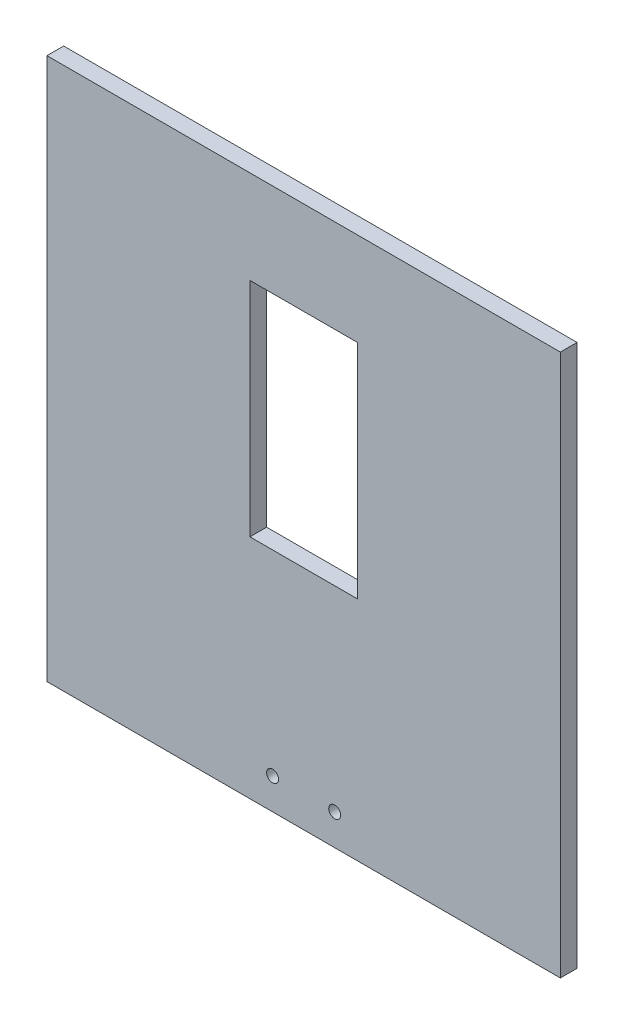
ISO-10303-21;
HEADER;
FILE_DESCRIPTION(('STEP AP214'),'2;1');
FILE_NAME('part.step','',(''),(''),'','','');
FILE_SCHEMA(('AUTOMOTIVE_DESIGN { 1 0 10303 214 1 1 1 1 }'));
ENDSEC;
DATA;
#1=APPLICATION_CONTEXT('core data for automotive mechanical design processes');
#2=APPLICATION_PROTOCOL_DEFINITION('international standard','automotive_design',2000,#1);
#3=PRODUCT_CONTEXT('',#1,'mechanical');
#4=PRODUCT('Part','Part','',(#3));
#5=PRODUCT_RELATED_PRODUCT_CATEGORY('part','',(#4));
#6=PRODUCT_DEFINITION_FORMATION('','',#4);
#7=PRODUCT_DEFINITION_CONTEXT('part definition',#1,'design');
#8=PRODUCT_DEFINITION('design','',#6,#7);
#9=PRODUCT_DEFINITION_SHAPE('','',#8);
#10=(LENGTH_UNIT() NAMED_UNIT(*) SI_UNIT(.MILLI.,.METRE.));
#11=(NAMED_UNIT(*) PLANE_ANGLE_UNIT() SI_UNIT($,.RADIAN.));
#12=(NAMED_UNIT(*) SI_UNIT($,.STERADIAN.) SOLID_ANGLE_UNIT());
#13=UNCERTAINTY_MEASURE_WITH_UNIT(LENGTH_MEASURE(1.E-05),#10,'distance_accuracy_value','');
#14=(GEOMETRIC_REPRESENTATION_CONTEXT(3) GLOBAL_UNCERTAINTY_ASSIGNED_CONTEXT((#13)) GLOBAL_UNIT_ASSIGNED_CONTEXT((#10,
#11,#12)) REPRESENTATION_CONTEXT('',''));
#15=CARTESIAN_POINT('',(0.,0.,0.));
#16=DIRECTION('',(0.,0.,1.));
#17=DIRECTION('',(1.,0.,0.));
#18=AXIS2_PLACEMENT_3D('',#15,#16,#17);
#19=CARTESIAN_POINT('',(0.,77.5893759990332,7.));
#20=DIRECTION('',(0.,1.,0.));
#21=DIRECTION('',(0.,0.,1.));
#22=AXIS2_PLACEMENT_3D('',#19,#20,#21);
#23=PLANE('',#22);
#24=DIRECTION('',(1.,0.,0.));
#25=VECTOR('',#24,1.);
#26=CARTESIAN_POINT('',(0.,77.5893759990332,0.));
#27=LINE('',#26,#25);
#28=CARTESIAN_POINT('',(-22.5,77.5893759990332,0.));
#29=VERTEX_POINT('',#28);
#30=CARTESIAN_POINT('',(22.5,77.5893759990332,0.));
#31=VERTEX_POINT('',#30);
#32=EDGE_CURVE('E149',#29,#31,#27,.T.);
#33=ORIENTED_EDGE('',*,*,#32,.T.);
#34=DIRECTION('',(0.,0.,-1.));
#35=VECTOR('',#34,1.);
#36=CARTESIAN_POINT('',(22.5,77.5893759990332,7.));
#37=LINE('',#36,#35);
#38=CARTESIAN_POINT('',(22.5,77.5893759990332,7.));
#39=VERTEX_POINT('',#38);
#40=EDGE_CURVE('E11',#39,#31,#37,.T.);
#41=ORIENTED_EDGE('',*,*,#40,.F.);
#42=DIRECTION('',(1.,0.,0.));
#43=VECTOR('',#42,1.);
#44=CARTESIAN_POINT('',(0.,77.5893759990332,7.));
#45=LINE('',#44,#43);
#46=CARTESIAN_POINT('',(-22.5,77.5893759990332,7.));
#47=VERTEX_POINT('',#46);
#48=EDGE_CURVE('E114',#47,#39,#45,.T.);
#49=ORIENTED_EDGE('',*,*,#48,.F.);
#50=DIRECTION('',(0.,0.,-1.));
#51=VECTOR('',#50,1.);
#52=CARTESIAN_POINT('',(-22.5,77.5893759990332,7.));
#53=LINE('',#52,#51);
#54=EDGE_CURVE('E53',#47,#29,#53,.T.);
#55=ORIENTED_EDGE('',*,*,#54,.T.);
#56=EDGE_LOOP('',(#33,#41,#49,#55));
#57=FACE_BOUND('',#56,.T.);
#58=ADVANCED_FACE('F34',(#57),#23,.F.);
#59=CARTESIAN_POINT('',(22.5,0.,7.));
#60=DIRECTION('',(1.,0.,0.));
#61=DIRECTION('',(0.,1.,0.));
#62=AXIS2_PLACEMENT_3D('',#59,#60,#61);
#63=PLANE('',#62);
#64=DIRECTION('',(0.,-1.,0.));
#65=VECTOR('',#64,1.);
#66=CARTESIAN_POINT('',(22.5,0.,0.));
#67=LINE('',#66,#65);
#68=CARTESIAN_POINT('',(22.5,-15.4106240009668,0.));
#69=VERTEX_POINT('',#68);
#70=EDGE_CURVE('E120',#31,#69,#67,.T.);
#71=ORIENTED_EDGE('',*,*,#70,.T.);
#72=DIRECTION('',(0.,0.,-1.));
#73=VECTOR('',#72,1.);
#74=CARTESIAN_POINT('',(22.5,-15.4106240009668,7.));
#75=LINE('',#74,#73);
#76=CARTESIAN_POINT('',(22.5,-15.4106240009668,7.));
#77=VERTEX_POINT('',#76);
#78=EDGE_CURVE('E44',#77,#69,#75,.T.);
#79=ORIENTED_EDGE('',*,*,#78,.F.);
#80=DIRECTION('',(0.,-1.,0.));
#81=VECTOR('',#80,1.);
#82=CARTESIAN_POINT('',(22.5,0.,7.));
#83=LINE('',#82,#81);
#84=EDGE_CURVE('E108',#39,#77,#83,.T.);
#85=ORIENTED_EDGE('',*,*,#84,.F.);
#86=ORIENTED_EDGE('',*,*,#40,.T.);
#87=EDGE_LOOP('',(#71,#79,#85,#86));
#88=FACE_BOUND('',#87,.T.);
#89=ADVANCED_FACE('F119',(#88),#63,.F.);
#90=CARTESIAN_POINT('',(0.,-15.4106240009668,7.));
#91=DIRECTION('',(0.,1.,0.));
#92=DIRECTION('',(-1.,0.,0.));
#93=AXIS2_PLACEMENT_3D('',#90,#91,#92);
#94=PLANE('',#93);
#95=DIRECTION('',(1.,0.,0.));
#96=VECTOR('',#95,1.);
#97=CARTESIAN_POINT('',(0.,-15.4106240009668,0.));
#98=LINE('',#97,#96);
#99=CARTESIAN_POINT('',(-22.5,-15.4106240009668,0.));
#100=VERTEX_POINT('',#99);
#101=EDGE_CURVE('E152',#100,#69,#98,.T.);
#102=ORIENTED_EDGE('',*,*,#101,.F.);
#103=DIRECTION('',(0.,0.,-1.));
#104=VECTOR('',#103,1.);
#105=CARTESIAN_POINT('',(-22.5,-15.4106240009668,7.));
#106=LINE('',#105,#104);
#107=CARTESIAN_POINT('',(-22.5,-15.4106240009668,7.));
#108=VERTEX_POINT('',#107);
#109=EDGE_CURVE('E79',#108,#100,#106,.T.);
#110=ORIENTED_EDGE('',*,*,#109,.F.);
#111=DIRECTION('',(1.,0.,0.));
#112=VECTOR('',#111,1.);
#113=CARTESIAN_POINT('',(0.,-15.4106240009668,7.));
#114=LINE('',#113,#112);
#115=EDGE_CURVE('E113',#108,#77,#114,.T.);
#116=ORIENTED_EDGE('',*,*,#115,.T.);
#117=ORIENTED_EDGE('',*,*,#78,.T.);
#118=EDGE_LOOP('',(#102,#110,#116,#117));
#119=FACE_BOUND('',#118,.T.);
#120=ADVANCED_FACE('F124',(#119),#94,.T.);
#121=CARTESIAN_POINT('',(0.,-110.410624000967,7.));
#122=DIRECTION('',(0.,1.,0.));
#123=DIRECTION('',(0.,0.,1.));
#124=AXIS2_PLACEMENT_3D('',#121,#122,#123);
#125=PLANE('',#124);
#126=DIRECTION('',(1.,0.,0.));
#127=VECTOR('',#126,1.);
#128=CARTESIAN_POINT('',(0.,-110.410624000967,0.));
#129=LINE('',#128,#127);
#130=CARTESIAN_POINT('',(-107.5,-110.410624000967,0.));
#131=VERTEX_POINT('',#130);
#132=CARTESIAN_POINT('',(107.5,-110.410624000967,0.));
#133=VERTEX_POINT('',#132);
#134=EDGE_CURVE('E137',#131,#133,#129,.T.);
#135=ORIENTED_EDGE('',*,*,#134,.T.);
#136=DIRECTION('',(0.,0.,-1.));
#137=VECTOR('',#136,1.);
#138=CARTESIAN_POINT('',(107.5,-110.410624000967,7.));
#139=LINE('',#138,#137);
#140=CARTESIAN_POINT('',(107.5,-110.410624000967,7.));
#141=VERTEX_POINT('',#140);
#142=EDGE_CURVE('E38',#141,#133,#139,.T.);
#143=ORIENTED_EDGE('',*,*,#142,.F.);
#144=DIRECTION('',(1.,0.,0.));
#145=VECTOR('',#144,1.);
#146=CARTESIAN_POINT('',(0.,-110.410624000967,7.));
#147=LINE('',#146,#145);
#148=CARTESIAN_POINT('',(-107.5,-110.410624000967,7.));
#149=VERTEX_POINT('',#148);
#150=EDGE_CURVE('E218',#149,#141,#147,.T.);
#151=ORIENTED_EDGE('',*,*,#150,.F.);
#152=DIRECTION('',(0.,0.,-1.));
#153=VECTOR('',#152,1.);
#154=CARTESIAN_POINT('',(-107.5,-110.410624000967,7.));
#155=LINE('',#154,#153);
#156=EDGE_CURVE('E127',#149,#131,#155,.T.);
#157=ORIENTED_EDGE('',*,*,#156,.T.);
#158=EDGE_LOOP('',(#135,#143,#151,#157));
#159=FACE_BOUND('',#158,.T.);
#160=ADVANCED_FACE('F171',(#159),#125,.F.);
#161=CARTESIAN_POINT('',(107.5,0.,7.));
#162=DIRECTION('',(-1.,0.,0.));
#163=DIRECTION('',(0.,0.,1.));
#164=AXIS2_PLACEMENT_3D('',#161,#162,#163);
#165=PLANE('',#164);
#166=DIRECTION('',(0.,1.,0.));
#167=VECTOR('',#166,1.);
#168=CARTESIAN_POINT('',(107.5,0.,0.));
#169=LINE('',#168,#167);
#170=CARTESIAN_POINT('',(107.5,116.589375999033,0.));
#171=VERTEX_POINT('',#170);
#172=EDGE_CURVE('E140',#133,#171,#169,.T.);
#173=ORIENTED_EDGE('',*,*,#172,.T.);
#174=DIRECTION('',(0.,0.,-1.));
#175=VECTOR('',#174,1.);
#176=CARTESIAN_POINT('',(107.5,116.589375999033,7.));
#177=LINE('',#176,#175);
#178=CARTESIAN_POINT('',(107.5,116.589375999033,7.));
#179=VERTEX_POINT('',#178);
#180=EDGE_CURVE('E162',#179,#171,#177,.T.);
#181=ORIENTED_EDGE('',*,*,#180,.F.);
#182=DIRECTION('',(0.,1.,0.));
#183=VECTOR('',#182,1.);
#184=CARTESIAN_POINT('',(107.5,0.,7.));
#185=LINE('',#184,#183);
#186=EDGE_CURVE('E92',#141,#179,#185,.T.);
#187=ORIENTED_EDGE('',*,*,#186,.F.);
#188=ORIENTED_EDGE('',*,*,#142,.T.);
#189=EDGE_LOOP('',(#173,#181,#187,#188));
#190=FACE_BOUND('',#189,.T.);
#191=ADVANCED_FACE('F167',(#190),#165,.F.);
#192=CARTESIAN_POINT('',(0.,116.589375999033,7.));
#193=DIRECTION('',(0.,1.,0.));
#194=DIRECTION('',(0.,0.,1.));
#195=AXIS2_PLACEMENT_3D('',#192,#193,#194);
#196=PLANE('',#195);
#197=DIRECTION('',(1.,0.,0.));
#198=VECTOR('',#197,1.);
#199=CARTESIAN_POINT('',(0.,116.589375999033,0.));
#200=LINE('',#199,#198);
#201=CARTESIAN_POINT('',(-107.5,116.589375999033,0.));
#202=VERTEX_POINT('',#201);
#203=EDGE_CURVE('E143',#202,#171,#200,.T.);
#204=ORIENTED_EDGE('',*,*,#203,.F.);
#205=DIRECTION('',(0.,0.,-1.));
#206=VECTOR('',#205,1.);
#207=CARTESIAN_POINT('',(-107.5,116.589375999033,7.));
#208=LINE('',#207,#206);
#209=CARTESIAN_POINT('',(-107.5,116.589375999033,7.));
#210=VERTEX_POINT('',#209);
#211=EDGE_CURVE('E161',#210,#202,#208,.T.);
#212=ORIENTED_EDGE('',*,*,#211,.F.);
#213=DIRECTION('',(1.,0.,0.));
#214=VECTOR('',#213,1.);
#215=CARTESIAN_POINT('',(0.,116.589375999033,7.));
#216=LINE('',#215,#214);
#217=EDGE_CURVE('E220',#210,#179,#216,.T.);
#218=ORIENTED_EDGE('',*,*,#217,.T.);
#219=ORIENTED_EDGE('',*,*,#180,.T.);
#220=EDGE_LOOP('',(#204,#212,#218,#219));
#221=FACE_BOUND('',#220,.T.);
#222=ADVANCED_FACE('F182',(#221),#196,.T.);
#223=CARTESIAN_POINT('',(-107.5,0.,7.));
#224=DIRECTION('',(-1.,0.,0.));
#225=DIRECTION('',(0.,0.,1.));
#226=AXIS2_PLACEMENT_3D('',#223,#224,#225);
#227=PLANE('',#226);
#228=DIRECTION('',(0.,1.,0.));
#229=VECTOR('',#228,1.);
#230=CARTESIAN_POINT('',(-107.5,0.,0.));
#231=LINE('',#230,#229);
#232=EDGE_CURVE('E146',#131,#202,#231,.T.);
#233=ORIENTED_EDGE('',*,*,#232,.F.);
#234=ORIENTED_EDGE('',*,*,#156,.F.);
#235=DIRECTION('',(0.,1.,0.));
#236=VECTOR('',#235,1.);
#237=CARTESIAN_POINT('',(-107.5,0.,7.));
#238=LINE('',#237,#236);
#239=EDGE_CURVE('E180',#149,#210,#238,.T.);
#240=ORIENTED_EDGE('',*,*,#239,.T.);
#241=ORIENTED_EDGE('',*,*,#211,.T.);
#242=EDGE_LOOP('',(#233,#234,#240,#241));
#243=FACE_BOUND('',#242,.T.);
#244=ADVANCED_FACE('F177',(#243),#227,.T.);
#245=CARTESIAN_POINT('',(-13.,-97.4106240009668,7.));
#246=DIRECTION('',(0.,0.,-1.));
#247=DIRECTION('',(-1.,0.,0.));
#248=AXIS2_PLACEMENT_3D('',#245,#246,#247);
#249=CYLINDRICAL_SURFACE('',#248,2.5);
#250=CARTESIAN_POINT('',(-13.,-97.4106240009668,7.));
#251=DIRECTION('',(0.,0.,1.));
#252=DIRECTION('',(1.,0.,0.));
#253=AXIS2_PLACEMENT_3D('',#250,#251,#252);
#254=CIRCLE('',#253,2.5);
#255=CARTESIAN_POINT('',(-10.5,-97.4106240009668,7.));
#256=VERTEX_POINT('',#255);
#257=EDGE_CURVE('E217',#256,#256,#254,.T.);
#258=ORIENTED_EDGE('',*,*,#257,.T.);
#259=EDGE_LOOP('',(#258));
#260=FACE_BOUND('',#259,.T.);
#261=CARTESIAN_POINT('',(-13.,-97.4106240009668,0.));
#262=DIRECTION('',(0.,0.,1.));
#263=DIRECTION('',(1.,0.,0.));
#264=AXIS2_PLACEMENT_3D('',#261,#262,#263);
#265=CIRCLE('',#264,2.5);
#266=CARTESIAN_POINT('',(-10.5,-97.4106240009668,0.));
#267=VERTEX_POINT('',#266);
#268=EDGE_CURVE('E134',#267,#267,#265,.T.);
#269=ORIENTED_EDGE('',*,*,#268,.F.);
#270=EDGE_LOOP('',(#269));
#271=FACE_BOUND('',#270,.T.);
#272=ADVANCED_FACE('F189',(#260,#271),#249,.F.);
#273=CARTESIAN_POINT('',(13.,-97.4106240009669,7.));
#274=DIRECTION('',(0.,0.,-1.));
#275=DIRECTION('',(-1.,0.,0.));
#276=AXIS2_PLACEMENT_3D('',#273,#274,#275);
#277=CYLINDRICAL_SURFACE('',#276,2.5);
#278=CARTESIAN_POINT('',(13.,-97.4106240009669,7.));
#279=DIRECTION('',(0.,0.,1.));
#280=DIRECTION('',(1.,0.,0.));
#281=AXIS2_PLACEMENT_3D('',#278,#279,#280);
#282=CIRCLE('',#281,2.5);
#283=CARTESIAN_POINT('',(15.5,-97.4106240009669,7.));
#284=VERTEX_POINT('',#283);
#285=EDGE_CURVE('E157',#284,#284,#282,.T.);
#286=ORIENTED_EDGE('',*,*,#285,.T.);
#287=EDGE_LOOP('',(#286));
#288=FACE_BOUND('',#287,.T.);
#289=CARTESIAN_POINT('',(13.,-97.4106240009669,0.));
#290=DIRECTION('',(0.,0.,1.));
#291=DIRECTION('',(1.,0.,0.));
#292=AXIS2_PLACEMENT_3D('',#289,#290,#291);
#293=CIRCLE('',#292,2.5);
#294=CARTESIAN_POINT('',(15.5,-97.4106240009669,0.));
#295=VERTEX_POINT('',#294);
#296=EDGE_CURVE('E131',#295,#295,#293,.T.);
#297=ORIENTED_EDGE('',*,*,#296,.F.);
#298=EDGE_LOOP('',(#297));
#299=FACE_BOUND('',#298,.T.);
#300=ADVANCED_FACE('F36',(#288,#299),#277,.F.);
#301=CARTESIAN_POINT('',(-22.5,0.,7.));
#302=DIRECTION('',(1.,0.,0.));
#303=DIRECTION('',(0.,1.,0.));
#304=AXIS2_PLACEMENT_3D('',#301,#302,#303);
#305=PLANE('',#304);
#306=DIRECTION('',(0.,-1.,0.));
#307=VECTOR('',#306,1.);
#308=CARTESIAN_POINT('',(-22.5,0.,0.));
#309=LINE('',#308,#307);
#310=EDGE_CURVE('E154',#29,#100,#309,.T.);
#311=ORIENTED_EDGE('',*,*,#310,.F.);
#312=ORIENTED_EDGE('',*,*,#54,.F.);
#313=DIRECTION('',(0.,-1.,0.));
#314=VECTOR('',#313,1.);
#315=CARTESIAN_POINT('',(-22.5,0.,7.));
#316=LINE('',#315,#314);
#317=EDGE_CURVE('E125',#47,#108,#316,.T.);
#318=ORIENTED_EDGE('',*,*,#317,.T.);
#319=ORIENTED_EDGE('',*,*,#109,.T.);
#320=EDGE_LOOP('',(#311,#312,#318,#319));
#321=FACE_BOUND('',#320,.T.);
#322=ADVANCED_FACE('F201',(#321),#305,.T.);
#323=CARTESIAN_POINT('',(0.,0.,7.));
#324=DIRECTION('',(0.,0.,1.));
#325=DIRECTION('',(1.,0.,0.));
#326=AXIS2_PLACEMENT_3D('',#323,#324,#325);
#327=PLANE('',#326);
#328=ORIENTED_EDGE('',*,*,#285,.F.);
#329=EDGE_LOOP('',(#328));
#330=FACE_BOUND('',#329,.T.);
#331=ORIENTED_EDGE('',*,*,#257,.F.);
#332=EDGE_LOOP('',(#331));
#333=FACE_BOUND('',#332,.T.);
#334=ORIENTED_EDGE('',*,*,#150,.T.);
#335=ORIENTED_EDGE('',*,*,#186,.T.);
#336=ORIENTED_EDGE('',*,*,#217,.F.);
#337=ORIENTED_EDGE('',*,*,#239,.F.);
#338=EDGE_LOOP('',(#334,#335,#336,#337));
#339=FACE_BOUND('',#338,.T.);
#340=ORIENTED_EDGE('',*,*,#48,.T.);
#341=ORIENTED_EDGE('',*,*,#84,.T.);
#342=ORIENTED_EDGE('',*,*,#115,.F.);
#343=ORIENTED_EDGE('',*,*,#317,.F.);
#344=EDGE_LOOP('',(#340,#341,#342,#343));
#345=FACE_BOUND('',#344,.T.);
#346=ADVANCED_FACE('F110',(#330,#333,#339,#345),#327,.T.);
#347=CARTESIAN_POINT('',(0.,0.,0.));
#348=DIRECTION('',(0.,0.,1.));
#349=DIRECTION('',(1.,0.,0.));
#350=AXIS2_PLACEMENT_3D('',#347,#348,#349);
#351=PLANE('',#350);
#352=ORIENTED_EDGE('',*,*,#296,.T.);
#353=EDGE_LOOP('',(#352));
#354=FACE_BOUND('',#353,.T.);
#355=ORIENTED_EDGE('',*,*,#268,.T.);
#356=EDGE_LOOP('',(#355));
#357=FACE_BOUND('',#356,.T.);
#358=ORIENTED_EDGE('',*,*,#134,.F.);
#359=ORIENTED_EDGE('',*,*,#232,.T.);
#360=ORIENTED_EDGE('',*,*,#203,.T.);
#361=ORIENTED_EDGE('',*,*,#172,.F.);
#362=EDGE_LOOP('',(#358,#359,#360,#361));
#363=FACE_BOUND('',#362,.T.);
#364=ORIENTED_EDGE('',*,*,#32,.F.);
#365=ORIENTED_EDGE('',*,*,#310,.T.);
#366=ORIENTED_EDGE('',*,*,#101,.T.);
#367=ORIENTED_EDGE('',*,*,#70,.F.);
#368=EDGE_LOOP('',(#364,#365,#366,#367));
#369=FACE_BOUND('',#368,.T.);
#370=ADVANCED_FACE('F174',(#354,#357,#363,#369),#351,.F.);
#371=CLOSED_SHELL('',(#58,#89,#120,#160,#191,#222,#244,#272,#300,#322,#346,#370));
#372=MANIFOLD_SOLID_BREP('B2',#371);
#373=ADVANCED_BREP_SHAPE_REPRESENTATION('',(#18,#372),#14);
#374=SHAPE_DEFINITION_REPRESENTATION(#9,#373);
ENDSEC;
END-ISO-10303-21;
